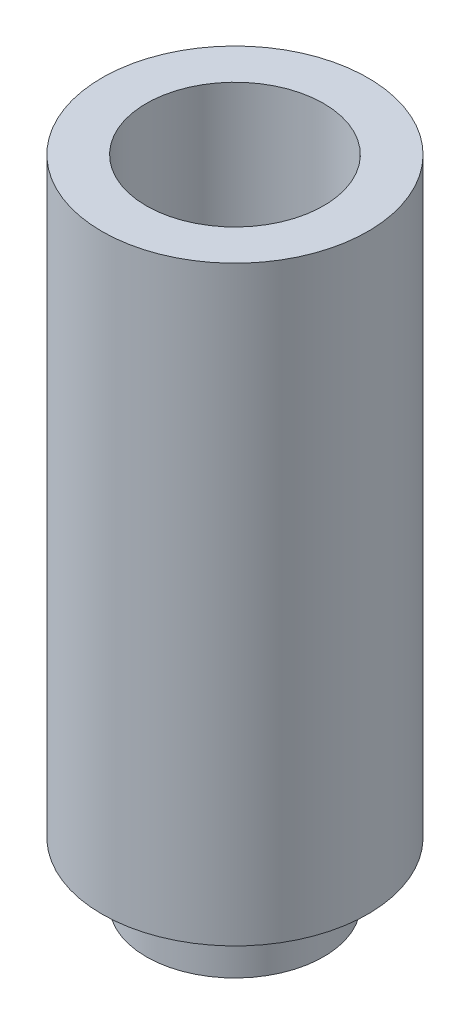
ISO-10303-21;
HEADER;
FILE_DESCRIPTION(('STEP AP214'),'2;1');
FILE_NAME('part.step','',(''),(''),'','','');
FILE_SCHEMA(('AUTOMOTIVE_DESIGN { 1 0 10303 214 1 1 1 1 }'));
ENDSEC;
DATA;
#1=APPLICATION_CONTEXT('core data for automotive mechanical design processes');
#2=APPLICATION_PROTOCOL_DEFINITION('international standard','automotive_design',2000,#1);
#3=PRODUCT_CONTEXT('',#1,'mechanical');
#4=PRODUCT('Part','Part','',(#3));
#5=PRODUCT_RELATED_PRODUCT_CATEGORY('part','',(#4));
#6=PRODUCT_DEFINITION_FORMATION('','',#4);
#7=PRODUCT_DEFINITION_CONTEXT('part definition',#1,'design');
#8=PRODUCT_DEFINITION('design','',#6,#7);
#9=PRODUCT_DEFINITION_SHAPE('','',#8);
#10=(LENGTH_UNIT() NAMED_UNIT(*) SI_UNIT(.MILLI.,.METRE.));
#11=(NAMED_UNIT(*) PLANE_ANGLE_UNIT() SI_UNIT($,.RADIAN.));
#12=(NAMED_UNIT(*) SI_UNIT($,.STERADIAN.) SOLID_ANGLE_UNIT());
#13=UNCERTAINTY_MEASURE_WITH_UNIT(LENGTH_MEASURE(1.E-05),#10,'distance_accuracy_value','');
#14=(GEOMETRIC_REPRESENTATION_CONTEXT(3) GLOBAL_UNCERTAINTY_ASSIGNED_CONTEXT((#13)) GLOBAL_UNIT_ASSIGNED_CONTEXT((#10,
#11,#12)) REPRESENTATION_CONTEXT('',''));
#15=CARTESIAN_POINT('',(0.,0.,0.));
#16=DIRECTION('',(0.,0.,1.));
#17=DIRECTION('',(1.,0.,0.));
#18=AXIS2_PLACEMENT_3D('',#15,#16,#17);
#19=CARTESIAN_POINT('',(0.,4.,0.));
#20=DIRECTION('',(0.,-1.,0.));
#21=DIRECTION('',(0.,0.,-1.));
#22=AXIS2_PLACEMENT_3D('',#19,#20,#21);
#23=CYLINDRICAL_SURFACE('',#22,6.);
#24=CARTESIAN_POINT('',(0.,4.,0.));
#25=DIRECTION('',(0.,1.,0.));
#26=DIRECTION('',(0.,0.,1.));
#27=AXIS2_PLACEMENT_3D('',#24,#25,#26);
#28=CIRCLE('',#27,6.);
#29=CARTESIAN_POINT('',(0.,4.,6.));
#30=VERTEX_POINT('',#29);
#31=EDGE_CURVE('E10',#30,#30,#28,.T.);
#32=ORIENTED_EDGE('',*,*,#31,.F.);
#33=EDGE_LOOP('',(#32));
#34=FACE_BOUND('',#33,.T.);
#35=CARTESIAN_POINT('',(0.,0.,0.));
#36=DIRECTION('',(0.,1.,0.));
#37=DIRECTION('',(0.,0.,1.));
#38=AXIS2_PLACEMENT_3D('',#35,#36,#37);
#39=CIRCLE('',#38,6.);
#40=CARTESIAN_POINT('',(0.,0.,6.));
#41=VERTEX_POINT('',#40);
#42=EDGE_CURVE('E34',#41,#41,#39,.T.);
#43=ORIENTED_EDGE('',*,*,#42,.T.);
#44=EDGE_LOOP('',(#43));
#45=FACE_BOUND('',#44,.T.);
#46=ADVANCED_FACE('F31',(#34,#45),#23,.T.);
#47=CARTESIAN_POINT('',(0.,0.,0.));
#48=DIRECTION('',(0.,1.,0.));
#49=DIRECTION('',(0.,0.,1.));
#50=AXIS2_PLACEMENT_3D('',#47,#48,#49);
#51=PLANE('',#50);
#52=CARTESIAN_POINT('',(0.,0.,0.));
#53=DIRECTION('',(0.,-1.,0.));
#54=DIRECTION('',(0.,0.,-1.));
#55=AXIS2_PLACEMENT_3D('',#52,#53,#54);
#56=CIRCLE('',#55,3.5);
#57=CARTESIAN_POINT('',(0.,0.,-3.5));
#58=VERTEX_POINT('',#57);
#59=EDGE_CURVE('E49',#58,#58,#56,.T.);
#60=ORIENTED_EDGE('',*,*,#59,.F.);
#61=EDGE_LOOP('',(#60));
#62=FACE_BOUND('',#61,.T.);
#63=ORIENTED_EDGE('',*,*,#42,.F.);
#64=EDGE_LOOP('',(#63));
#65=FACE_BOUND('',#64,.T.);
#66=ADVANCED_FACE('F85',(#62,#65),#51,.F.);
#67=CARTESIAN_POINT('',(0.,4.,0.));
#68=DIRECTION('',(0.,1.,0.));
#69=DIRECTION('',(0.,0.,1.));
#70=AXIS2_PLACEMENT_3D('',#67,#68,#69);
#71=PLANE('',#70);
#72=CARTESIAN_POINT('',(0.,4.,0.));
#73=DIRECTION('',(0.,1.,0.));
#74=DIRECTION('',(0.,0.,1.));
#75=AXIS2_PLACEMENT_3D('',#72,#73,#74);
#76=CIRCLE('',#75,9.);
#77=CARTESIAN_POINT('',(0.,4.,9.));
#78=VERTEX_POINT('',#77);
#79=EDGE_CURVE('E43',#78,#78,#76,.T.);
#80=ORIENTED_EDGE('',*,*,#79,.F.);
#81=EDGE_LOOP('',(#80));
#82=FACE_BOUND('',#81,.T.);
#83=ORIENTED_EDGE('',*,*,#31,.T.);
#84=EDGE_LOOP('',(#83));
#85=FACE_BOUND('',#84,.T.);
#86=ADVANCED_FACE('F80',(#82,#85),#71,.F.);
#87=CARTESIAN_POINT('',(0.,44.,0.));
#88=DIRECTION('',(0.,-1.,0.));
#89=DIRECTION('',(0.,0.,-1.));
#90=AXIS2_PLACEMENT_3D('',#87,#88,#89);
#91=CYLINDRICAL_SURFACE('',#90,9.);
#92=CARTESIAN_POINT('',(0.,44.,0.));
#93=DIRECTION('',(0.,1.,0.));
#94=DIRECTION('',(0.,0.,1.));
#95=AXIS2_PLACEMENT_3D('',#92,#93,#94);
#96=CIRCLE('',#95,9.);
#97=CARTESIAN_POINT('',(0.,44.,9.));
#98=VERTEX_POINT('',#97);
#99=EDGE_CURVE('E41',#98,#98,#96,.T.);
#100=ORIENTED_EDGE('',*,*,#99,.F.);
#101=EDGE_LOOP('',(#100));
#102=FACE_BOUND('',#101,.T.);
#103=ORIENTED_EDGE('',*,*,#79,.T.);
#104=EDGE_LOOP('',(#103));
#105=FACE_BOUND('',#104,.T.);
#106=ADVANCED_FACE('F74',(#102,#105),#91,.T.);
#107=CARTESIAN_POINT('',(0.,44.,0.));
#108=DIRECTION('',(0.,1.,0.));
#109=DIRECTION('',(0.,0.,1.));
#110=AXIS2_PLACEMENT_3D('',#107,#108,#109);
#111=PLANE('',#110);
#112=CARTESIAN_POINT('',(0.,44.,0.));
#113=DIRECTION('',(0.,1.,0.));
#114=DIRECTION('',(0.,0.,1.));
#115=AXIS2_PLACEMENT_3D('',#112,#113,#114);
#116=CIRCLE('',#115,6.);
#117=CARTESIAN_POINT('',(0.,44.,6.));
#118=VERTEX_POINT('',#117);
#119=EDGE_CURVE('E55',#118,#118,#116,.T.);
#120=ORIENTED_EDGE('',*,*,#119,.F.);
#121=EDGE_LOOP('',(#120));
#122=FACE_BOUND('',#121,.T.);
#123=ORIENTED_EDGE('',*,*,#99,.T.);
#124=EDGE_LOOP('',(#123));
#125=FACE_BOUND('',#124,.T.);
#126=ADVANCED_FACE('F70',(#122,#125),#111,.T.);
#127=CARTESIAN_POINT('',(0.,4.,0.));
#128=DIRECTION('',(0.,-1.,0.));
#129=DIRECTION('',(0.,0.,-1.));
#130=AXIS2_PLACEMENT_3D('',#127,#128,#129);
#131=CYLINDRICAL_SURFACE('',#130,3.5);
#132=CARTESIAN_POINT('',(0.,4.,0.));
#133=DIRECTION('',(0.,-1.,0.));
#134=DIRECTION('',(0.,0.,-1.));
#135=AXIS2_PLACEMENT_3D('',#132,#133,#134);
#136=CIRCLE('',#135,3.5);
#137=CARTESIAN_POINT('',(0.,4.,-3.5));
#138=VERTEX_POINT('',#137);
#139=EDGE_CURVE('E46',#138,#138,#136,.T.);
#140=ORIENTED_EDGE('',*,*,#139,.F.);
#141=EDGE_LOOP('',(#140));
#142=FACE_BOUND('',#141,.T.);
#143=ORIENTED_EDGE('',*,*,#59,.T.);
#144=EDGE_LOOP('',(#143));
#145=FACE_BOUND('',#144,.T.);
#146=ADVANCED_FACE('F73',(#142,#145),#131,.F.);
#147=CARTESIAN_POINT('',(0.,4.,0.));
#148=DIRECTION('',(0.,-1.,0.));
#149=DIRECTION('',(0.,0.,-1.));
#150=AXIS2_PLACEMENT_3D('',#147,#148,#149);
#151=PLANE('',#150);
#152=ORIENTED_EDGE('',*,*,#139,.T.);
#153=EDGE_LOOP('',(#152));
#154=FACE_BOUND('',#153,.T.);
#155=ADVANCED_FACE('F66',(#154),#151,.T.);
#156=CARTESIAN_POINT('',(0.,34.,0.));
#157=DIRECTION('',(0.,1.,0.));
#158=DIRECTION('',(0.,0.,1.));
#159=AXIS2_PLACEMENT_3D('',#156,#157,#158);
#160=CYLINDRICAL_SURFACE('',#159,6.);
#161=CARTESIAN_POINT('',(0.,34.,0.));
#162=DIRECTION('',(0.,1.,0.));
#163=DIRECTION('',(0.,0.,1.));
#164=AXIS2_PLACEMENT_3D('',#161,#162,#163);
#165=CIRCLE('',#164,6.);
#166=CARTESIAN_POINT('',(0.,34.,6.));
#167=VERTEX_POINT('',#166);
#168=EDGE_CURVE('E52',#167,#167,#165,.T.);
#169=ORIENTED_EDGE('',*,*,#168,.F.);
#170=EDGE_LOOP('',(#169));
#171=FACE_BOUND('',#170,.T.);
#172=ORIENTED_EDGE('',*,*,#119,.T.);
#173=EDGE_LOOP('',(#172));
#174=FACE_BOUND('',#173,.T.);
#175=ADVANCED_FACE('F63',(#171,#174),#160,.F.);
#176=CARTESIAN_POINT('',(0.,34.,0.));
#177=DIRECTION('',(0.,1.,0.));
#178=DIRECTION('',(0.,0.,1.));
#179=AXIS2_PLACEMENT_3D('',#176,#177,#178);
#180=PLANE('',#179);
#181=ORIENTED_EDGE('',*,*,#168,.T.);
#182=EDGE_LOOP('',(#181));
#183=FACE_BOUND('',#182,.T.);
#184=ADVANCED_FACE('F61',(#183),#180,.T.);
#185=CLOSED_SHELL('',(#46,#66,#86,#106,#126,#146,#155,#175,#184));
#186=MANIFOLD_SOLID_BREP('B2',#185);
#187=ADVANCED_BREP_SHAPE_REPRESENTATION('',(#18,#186),#14);
#188=SHAPE_DEFINITION_REPRESENTATION(#9,#187);
ENDSEC;
END-ISO-10303-21;
